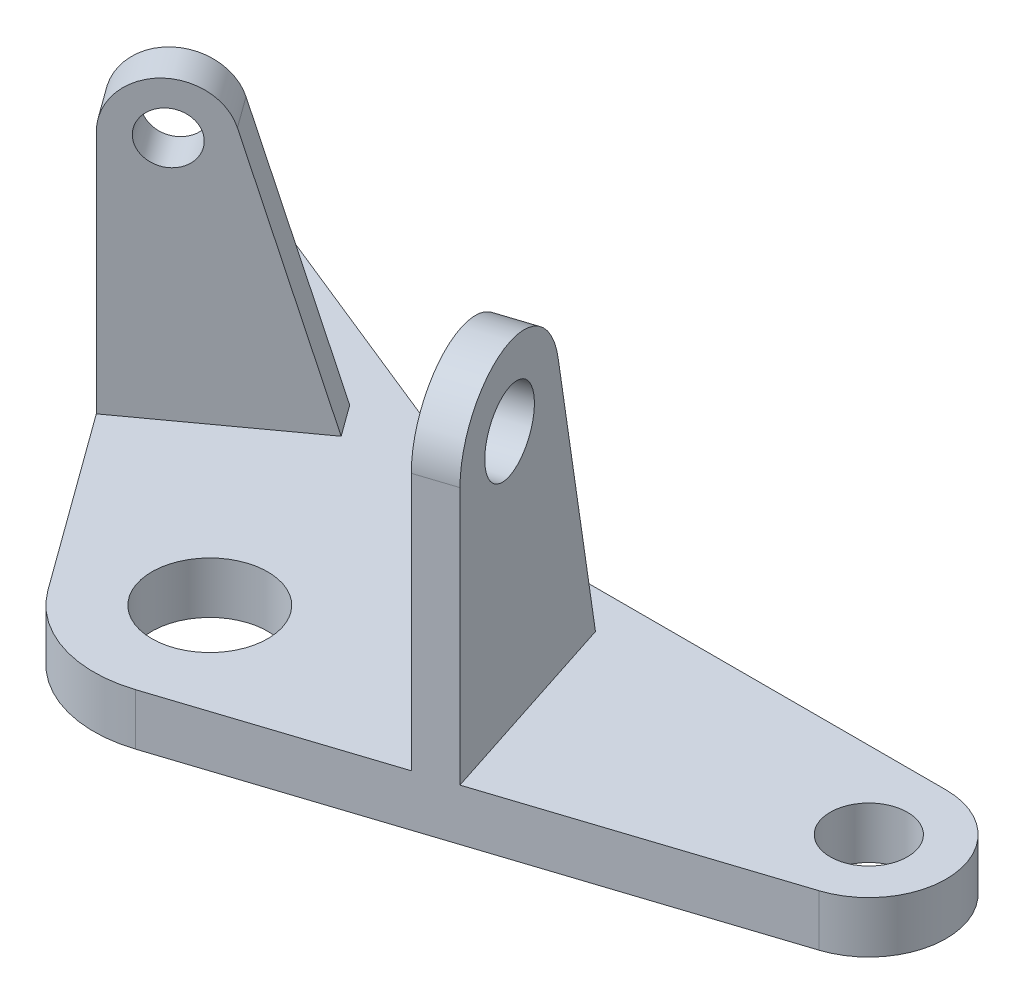
ISO-10303-21;
HEADER;
FILE_DESCRIPTION(('STEP AP214'),'2;1');
FILE_NAME('part.step','',(''),(''),'','','');
FILE_SCHEMA(('AUTOMOTIVE_DESIGN { 1 0 10303 214 1 1 1 1 }'));
ENDSEC;
DATA;
#1=APPLICATION_CONTEXT('core data for automotive mechanical design processes');
#2=APPLICATION_PROTOCOL_DEFINITION('international standard','automotive_design',2000,#1);
#3=PRODUCT_CONTEXT('',#1,'mechanical');
#4=PRODUCT('Part','Part','',(#3));
#5=PRODUCT_RELATED_PRODUCT_CATEGORY('part','',(#4));
#6=PRODUCT_DEFINITION_FORMATION('','',#4);
#7=PRODUCT_DEFINITION_CONTEXT('part definition',#1,'design');
#8=PRODUCT_DEFINITION('design','',#6,#7);
#9=PRODUCT_DEFINITION_SHAPE('','',#8);
#10=(LENGTH_UNIT() NAMED_UNIT(*) SI_UNIT(.MILLI.,.METRE.));
#11=(NAMED_UNIT(*) PLANE_ANGLE_UNIT() SI_UNIT($,.RADIAN.));
#12=(NAMED_UNIT(*) SI_UNIT($,.STERADIAN.) SOLID_ANGLE_UNIT());
#13=UNCERTAINTY_MEASURE_WITH_UNIT(LENGTH_MEASURE(1.E-05),#10,'distance_accuracy_value','');
#14=(GEOMETRIC_REPRESENTATION_CONTEXT(3) GLOBAL_UNCERTAINTY_ASSIGNED_CONTEXT((#13)) GLOBAL_UNIT_ASSIGNED_CONTEXT((#10,
#11,#12)) REPRESENTATION_CONTEXT('',''));
#15=CARTESIAN_POINT('',(0.,0.,0.));
#16=DIRECTION('',(0.,0.,1.));
#17=DIRECTION('',(1.,0.,0.));
#18=AXIS2_PLACEMENT_3D('',#15,#16,#17);
#19=CARTESIAN_POINT('',(82.,8.,-20.3346417456688));
#20=DIRECTION('',(0.,1.,0.));
#21=DIRECTION('',(0.,0.,1.));
#22=AXIS2_PLACEMENT_3D('',#19,#20,#21);
#23=PLANE('',#22);
#24=DIRECTION('',(-0.309016994374949,0.,-0.951056516295153));
#25=VECTOR('',#24,1.);
#26=CARTESIAN_POINT('',(38.0422606518061,8.,-12.360679774998));
#27=LINE('',#26,#25);
#28=CARTESIAN_POINT('',(43.6045665505552,8.,4.75833751831481));
#29=VERTEX_POINT('',#28);
#30=CARTESIAN_POINT('',(33.4779716109458,8.,-26.4081170149633));
#31=VERTEX_POINT('',#30);
#32=EDGE_CURVE('E176',#29,#31,#27,.T.);
#33=ORIENTED_EDGE('',*,*,#32,.F.);
#34=DIRECTION('',(0.951056516295153,0.,-0.309016994374949));
#35=VECTOR('',#34,1.);
#36=CARTESIAN_POINT('',(85.7082039324994,8.,-8.92196355012698));
#37=LINE('',#36,#35);
#38=CARTESIAN_POINT('',(85.7082039324994,8.,-8.92196355012698));
#39=VERTEX_POINT('',#38);
#40=EDGE_CURVE('E287',#29,#39,#37,.T.);
#41=ORIENTED_EDGE('',*,*,#40,.T.);
#42=CARTESIAN_POINT('',(82.,8.,-20.3346417456688));
#43=DIRECTION('',(0.,1.,0.));
#44=DIRECTION('',(0.,0.,1.));
#45=AXIS2_PLACEMENT_3D('',#42,#43,#44);
#46=CIRCLE('',#45,12.);
#47=CARTESIAN_POINT('',(82.,8.,-32.3346417456688));
#48=VERTEX_POINT('',#47);
#49=EDGE_CURVE('E266',#39,#48,#46,.T.);
#50=ORIENTED_EDGE('',*,*,#49,.T.);
#51=DIRECTION('',(-1.,0.,0.));
#52=VECTOR('',#51,1.);
#53=CARTESIAN_POINT('',(82.,8.,-32.3346417456688));
#54=LINE('',#53,#52);
#55=CARTESIAN_POINT('',(22.89988117621,8.,-32.3346417456688));
#56=VERTEX_POINT('',#55);
#57=EDGE_CURVE('E270',#48,#56,#54,.T.);
#58=ORIENTED_EDGE('',*,*,#57,.T.);
#59=CARTESIAN_POINT('',(22.89988117621,8.,-74.3346417456688));
#60=DIRECTION('',(0.,1.,0.));
#61=DIRECTION('',(0.,0.,1.));
#62=AXIS2_PLACEMENT_3D('',#59,#60,#61);
#63=CIRCLE('',#62,42.);
#64=CARTESIAN_POINT('',(7.16640425274162,8.,-35.3929198538638));
#65=VERTEX_POINT('',#64);
#66=EDGE_CURVE('E11',#56,#65,#63,.F.);
#67=ORIENTED_EDGE('',*,*,#66,.T.);
#68=DIRECTION('',(-0.927183854566787,0.,-0.374606593415913));
#69=VECTOR('',#68,1.);
#70=CARTESIAN_POINT('',(14.7359081924258,8.,-32.3346417456688));
#71=LINE('',#70,#69);
#72=CARTESIAN_POINT('',(-45.0031472526727,8.,-56.4707868521092));
#73=VERTEX_POINT('',#72);
#74=EDGE_CURVE('E274',#65,#73,#71,.T.);
#75=ORIENTED_EDGE('',*,*,#74,.T.);
#76=CARTESIAN_POINT('',(-48.,8.,-49.0533160155749));
#77=DIRECTION('',(0.,1.,0.));
#78=DIRECTION('',(0.,0.,1.));
#79=AXIS2_PLACEMENT_3D('',#76,#77,#78);
#80=CIRCLE('',#79,7.99999999999999);
#81=CARTESIAN_POINT('',(-54.4721359549996,8.,-44.3510339972351));
#82=VERTEX_POINT('',#81);
#83=EDGE_CURVE('E277',#73,#82,#80,.T.);
#84=ORIENTED_EDGE('',*,*,#83,.T.);
#85=DIRECTION('',(0.587785252292478,0.,0.809016994374944));
#86=VECTOR('',#85,1.);
#87=CARTESIAN_POINT('',(-54.4721359549996,8.,-44.3510339972351));
#88=LINE('',#87,#86);
#89=CARTESIAN_POINT('',(-38.0737159904481,8.,-21.7805452337332));
#90=VERTEX_POINT('',#89);
#91=EDGE_CURVE('E281',#82,#90,#88,.T.);
#92=ORIENTED_EDGE('',*,*,#91,.T.);
#93=DIRECTION('',(0.809016994374944,0.,-0.587785252292478));
#94=VECTOR('',#93,1.);
#95=CARTESIAN_POINT('',(-23.5114100916991,8.,-32.3606797749978));
#96=LINE('',#95,#94);
#97=CARTESIAN_POINT('',(-16.0533088274187,8.,-37.7793075216681));
#98=VERTEX_POINT('',#97);
#99=EDGE_CURVE('E225',#90,#98,#96,.T.);
#100=ORIENTED_EDGE('',*,*,#99,.T.);
#101=DIRECTION('',(-0.587785252292478,0.,-0.809016994374944));
#102=VECTOR('',#101,1.);
#103=CARTESIAN_POINT('',(-12.5265973136639,8.,-32.9252055554184));
#104=LINE('',#103,#102);
#105=CARTESIAN_POINT('',(-12.5265973136639,8.,-32.9252055554184));
#106=VERTEX_POINT('',#105);
#107=EDGE_CURVE('E216',#106,#98,#104,.T.);
#108=ORIENTED_EDGE('',*,*,#107,.F.);
#109=DIRECTION('',(0.809016994374944,0.,-0.587785252292478));
#110=VECTOR('',#109,1.);
#111=CARTESIAN_POINT('',(-19.9846985779442,8.,-27.5065778087481));
#112=LINE('',#111,#110);
#113=CARTESIAN_POINT('',(-34.5470044766932,8.,-16.9264432674835));
#114=VERTEX_POINT('',#113);
#115=EDGE_CURVE('E209',#114,#106,#112,.T.);
#116=ORIENTED_EDGE('',*,*,#115,.F.);
#117=CARTESIAN_POINT('',(-14.562305898749,8.,10.5801345412646));
#118=VERTEX_POINT('',#117);
#119=EDGE_CURVE('E280',#114,#118,#88,.T.);
#120=ORIENTED_EDGE('',*,*,#119,.T.);
#121=CARTESIAN_POINT('',(0.,8.,0.));
#122=DIRECTION('',(0.,1.,0.));
#123=DIRECTION('',(0.,0.,1.));
#124=AXIS2_PLACEMENT_3D('',#121,#122,#123);
#125=CIRCLE('',#124,18.);
#126=CARTESIAN_POINT('',(5.56230589874908,8.,17.1190172933127));
#127=VERTEX_POINT('',#126);
#128=EDGE_CURVE('E284',#118,#127,#125,.T.);
#129=ORIENTED_EDGE('',*,*,#128,.T.);
#130=CARTESIAN_POINT('',(37.8982274527843,8.,6.61243948456451));
#131=VERTEX_POINT('',#130);
#132=EDGE_CURVE('E288',#127,#131,#37,.T.);
#133=ORIENTED_EDGE('',*,*,#132,.T.);
#134=DIRECTION('',(-0.309016994374949,0.,-0.951056516295153));
#135=VECTOR('',#134,1.);
#136=CARTESIAN_POINT('',(32.3359215540352,8.,-10.5065778087483));
#137=LINE('',#136,#135);
#138=CARTESIAN_POINT('',(27.7716325131749,8.,-24.5540150487136));
#139=VERTEX_POINT('',#138);
#140=EDGE_CURVE('E364',#131,#139,#137,.T.);
#141=ORIENTED_EDGE('',*,*,#140,.T.);
#142=DIRECTION('',(-0.951056516295153,0.,0.309016994374949));
#143=VECTOR('',#142,1.);
#144=CARTESIAN_POINT('',(33.4779716109458,8.,-26.4081170149633));
#145=LINE('',#144,#143);
#146=EDGE_CURVE('E193',#31,#139,#145,.T.);
#147=ORIENTED_EDGE('',*,*,#146,.F.);
#148=EDGE_LOOP('',(#33,#41,#50,#58,#67,#75,#84,#92,#100,#108,#116,#120,#129,#133,#141,#147));
#149=FACE_BOUND('',#148,.T.);
#150=CARTESIAN_POINT('',(82.,8.,-20.3346417456688));
#151=DIRECTION('',(0.,1.,0.));
#152=DIRECTION('',(0.,0.,1.));
#153=AXIS2_PLACEMENT_3D('',#150,#151,#152);
#154=CIRCLE('',#153,6.);
#155=CARTESIAN_POINT('',(82.,8.,-14.3346417456688));
#156=VERTEX_POINT('',#155);
#157=EDGE_CURVE('E250',#156,#156,#154,.T.);
#158=ORIENTED_EDGE('',*,*,#157,.F.);
#159=EDGE_LOOP('',(#158));
#160=FACE_BOUND('',#159,.T.);
#161=CARTESIAN_POINT('',(0.,8.,0.));
#162=DIRECTION('',(0.,1.,0.));
#163=DIRECTION('',(0.,0.,1.));
#164=AXIS2_PLACEMENT_3D('',#161,#162,#163);
#165=CIRCLE('',#164,9.);
#166=CARTESIAN_POINT('',(0.,8.,9.));
#167=VERTEX_POINT('',#166);
#168=EDGE_CURVE('E258',#167,#167,#165,.T.);
#169=ORIENTED_EDGE('',*,*,#168,.F.);
#170=EDGE_LOOP('',(#169));
#171=FACE_BOUND('',#170,.T.);
#172=CARTESIAN_POINT('',(-48.,8.,-49.0533160155749));
#173=DIRECTION('',(0.,1.,0.));
#174=DIRECTION('',(0.,0.,1.));
#175=AXIS2_PLACEMENT_3D('',#172,#173,#174);
#176=CIRCLE('',#175,4.00000000000001);
#177=CARTESIAN_POINT('',(-48.,8.,-45.0533160155749));
#178=VERTEX_POINT('',#177);
#179=EDGE_CURVE('E242',#178,#178,#176,.T.);
#180=ORIENTED_EDGE('',*,*,#179,.F.);
#181=EDGE_LOOP('',(#180));
#182=FACE_BOUND('',#181,.T.);
#183=ADVANCED_FACE('F44',(#149,#160,#171,#182),#23,.T.);
#184=CARTESIAN_POINT('',(82.,0.,-20.3346417456688));
#185=DIRECTION('',(0.,1.,0.));
#186=DIRECTION('',(0.,0.,1.));
#187=AXIS2_PLACEMENT_3D('',#184,#185,#186);
#188=PLANE('',#187);
#189=CARTESIAN_POINT('',(82.,0.,-20.3346417456688));
#190=DIRECTION('',(0.,1.,0.));
#191=DIRECTION('',(0.,0.,1.));
#192=AXIS2_PLACEMENT_3D('',#189,#190,#191);
#193=CIRCLE('',#192,12.);
#194=CARTESIAN_POINT('',(85.7082039324994,0.,-8.92196355012698));
#195=VERTEX_POINT('',#194);
#196=CARTESIAN_POINT('',(82.,0.,-32.3346417456688));
#197=VERTEX_POINT('',#196);
#198=EDGE_CURVE('E262',#195,#197,#193,.T.);
#199=ORIENTED_EDGE('',*,*,#198,.F.);
#200=DIRECTION('',(0.951056516295153,0.,-0.309016994374949));
#201=VECTOR('',#200,1.);
#202=CARTESIAN_POINT('',(85.7082039324994,0.,-8.92196355012698));
#203=LINE('',#202,#201);
#204=CARTESIAN_POINT('',(5.56230589874908,0.,17.1190172933127));
#205=VERTEX_POINT('',#204);
#206=EDGE_CURVE('E271',#205,#195,#203,.T.);
#207=ORIENTED_EDGE('',*,*,#206,.F.);
#208=CARTESIAN_POINT('',(0.,0.,0.));
#209=DIRECTION('',(0.,1.,0.));
#210=DIRECTION('',(0.,0.,1.));
#211=AXIS2_PLACEMENT_3D('',#208,#209,#210);
#212=CIRCLE('',#211,18.);
#213=CARTESIAN_POINT('',(-14.562305898749,0.,10.5801345412646));
#214=VERTEX_POINT('',#213);
#215=EDGE_CURVE('E307',#214,#205,#212,.T.);
#216=ORIENTED_EDGE('',*,*,#215,.F.);
#217=DIRECTION('',(0.587785252292478,0.,0.809016994374944));
#218=VECTOR('',#217,1.);
#219=CARTESIAN_POINT('',(-54.4721359549996,0.,-44.3510339972351));
#220=LINE('',#219,#218);
#221=CARTESIAN_POINT('',(-54.4721359549996,0.,-44.3510339972351));
#222=VERTEX_POINT('',#221);
#223=EDGE_CURVE('E304',#222,#214,#220,.T.);
#224=ORIENTED_EDGE('',*,*,#223,.F.);
#225=CARTESIAN_POINT('',(-48.,0.,-49.0533160155749));
#226=DIRECTION('',(0.,1.,0.));
#227=DIRECTION('',(0.,0.,1.));
#228=AXIS2_PLACEMENT_3D('',#225,#226,#227);
#229=CIRCLE('',#228,7.99999999999999);
#230=CARTESIAN_POINT('',(-45.0031472526727,0.,-56.4707868521092));
#231=VERTEX_POINT('',#230);
#232=EDGE_CURVE('E301',#231,#222,#229,.T.);
#233=ORIENTED_EDGE('',*,*,#232,.F.);
#234=DIRECTION('',(-0.927183854566787,0.,-0.374606593415913));
#235=VECTOR('',#234,1.);
#236=CARTESIAN_POINT('',(14.7359081924258,0.,-32.3346417456688));
#237=LINE('',#236,#235);
#238=CARTESIAN_POINT('',(7.16640425274162,0.,-35.3929198538638));
#239=VERTEX_POINT('',#238);
#240=EDGE_CURVE('E298',#239,#231,#237,.T.);
#241=ORIENTED_EDGE('',*,*,#240,.F.);
#242=CARTESIAN_POINT('',(22.89988117621,0.,-74.3346417456688));
#243=DIRECTION('',(0.,1.,0.));
#244=DIRECTION('',(0.,0.,1.));
#245=AXIS2_PLACEMENT_3D('',#242,#243,#244);
#246=CIRCLE('',#245,42.);
#247=CARTESIAN_POINT('',(22.89988117621,0.,-32.3346417456688));
#248=VERTEX_POINT('',#247);
#249=EDGE_CURVE('E53',#239,#248,#246,.T.);
#250=ORIENTED_EDGE('',*,*,#249,.T.);
#251=DIRECTION('',(-1.,0.,0.));
#252=VECTOR('',#251,1.);
#253=CARTESIAN_POINT('',(82.,0.,-32.3346417456688));
#254=LINE('',#253,#252);
#255=EDGE_CURVE('E295',#197,#248,#254,.T.);
#256=ORIENTED_EDGE('',*,*,#255,.F.);
#257=EDGE_LOOP('',(#199,#207,#216,#224,#233,#241,#250,#256));
#258=FACE_BOUND('',#257,.T.);
#259=CARTESIAN_POINT('',(0.,0.,0.));
#260=DIRECTION('',(0.,1.,0.));
#261=DIRECTION('',(0.,0.,1.));
#262=AXIS2_PLACEMENT_3D('',#259,#260,#261);
#263=CIRCLE('',#262,9.);
#264=CARTESIAN_POINT('',(0.,0.,9.));
#265=VERTEX_POINT('',#264);
#266=EDGE_CURVE('E254',#265,#265,#263,.T.);
#267=ORIENTED_EDGE('',*,*,#266,.T.);
#268=EDGE_LOOP('',(#267));
#269=FACE_BOUND('',#268,.T.);
#270=CARTESIAN_POINT('',(82.,0.,-20.3346417456688));
#271=DIRECTION('',(0.,1.,0.));
#272=DIRECTION('',(0.,0.,1.));
#273=AXIS2_PLACEMENT_3D('',#270,#271,#272);
#274=CIRCLE('',#273,6.);
#275=CARTESIAN_POINT('',(82.,0.,-14.3346417456688));
#276=VERTEX_POINT('',#275);
#277=EDGE_CURVE('E246',#276,#276,#274,.T.);
#278=ORIENTED_EDGE('',*,*,#277,.T.);
#279=EDGE_LOOP('',(#278));
#280=FACE_BOUND('',#279,.T.);
#281=CARTESIAN_POINT('',(-48.,0.,-49.0533160155749));
#282=DIRECTION('',(0.,1.,0.));
#283=DIRECTION('',(0.,0.,1.));
#284=AXIS2_PLACEMENT_3D('',#281,#282,#283);
#285=CIRCLE('',#284,4.00000000000001);
#286=CARTESIAN_POINT('',(-48.,0.,-45.0533160155749));
#287=VERTEX_POINT('',#286);
#288=EDGE_CURVE('E241',#287,#287,#285,.T.);
#289=ORIENTED_EDGE('',*,*,#288,.T.);
#290=EDGE_LOOP('',(#289));
#291=FACE_BOUND('',#290,.T.);
#292=ADVANCED_FACE('F443',(#258,#269,#280,#291),#188,.F.);
#293=CARTESIAN_POINT('',(82.,8.,-20.3346417456688));
#294=DIRECTION('',(0.,-1.,0.));
#295=DIRECTION('',(0.,0.,-1.));
#296=AXIS2_PLACEMENT_3D('',#293,#294,#295);
#297=CYLINDRICAL_SURFACE('',#296,12.);
#298=ORIENTED_EDGE('',*,*,#198,.T.);
#299=DIRECTION('',(0.,-1.,0.));
#300=VECTOR('',#299,1.);
#301=CARTESIAN_POINT('',(82.,8.,-32.3346417456688));
#302=LINE('',#301,#300);
#303=EDGE_CURVE('E331',#48,#197,#302,.T.);
#304=ORIENTED_EDGE('',*,*,#303,.F.);
#305=ORIENTED_EDGE('',*,*,#49,.F.);
#306=DIRECTION('',(0.,-1.,0.));
#307=VECTOR('',#306,1.);
#308=CARTESIAN_POINT('',(85.7082039324994,8.,-8.92196355012698));
#309=LINE('',#308,#307);
#310=EDGE_CURVE('E291',#39,#195,#309,.T.);
#311=ORIENTED_EDGE('',*,*,#310,.T.);
#312=EDGE_LOOP('',(#298,#304,#305,#311));
#313=FACE_BOUND('',#312,.T.);
#314=ADVANCED_FACE('F396',(#313),#297,.T.);
#315=CARTESIAN_POINT('',(82.,8.,-32.3346417456688));
#316=DIRECTION('',(0.,0.,1.));
#317=DIRECTION('',(1.,0.,0.));
#318=AXIS2_PLACEMENT_3D('',#315,#316,#317);
#319=PLANE('',#318);
#320=ORIENTED_EDGE('',*,*,#255,.T.);
#321=DIRECTION('',(0.,-1.,0.));
#322=VECTOR('',#321,1.);
#323=CARTESIAN_POINT('',(22.89988117621,8.,-32.3346417456688));
#324=LINE('',#323,#322);
#325=EDGE_CURVE('E60',#248,#56,#324,.F.);
#326=ORIENTED_EDGE('',*,*,#325,.T.);
#327=ORIENTED_EDGE('',*,*,#57,.F.);
#328=ORIENTED_EDGE('',*,*,#303,.T.);
#329=EDGE_LOOP('',(#320,#326,#327,#328));
#330=FACE_BOUND('',#329,.T.);
#331=ADVANCED_FACE('F398',(#330),#319,.F.);
#332=CARTESIAN_POINT('',(14.7359081924258,8.,-32.3346417456688));
#333=DIRECTION('',(-0.374606593415913,0.,0.927183854566787));
#334=DIRECTION('',(0.927183854566787,0.,0.374606593415913));
#335=AXIS2_PLACEMENT_3D('',#332,#333,#334);
#336=PLANE('',#335);
#337=ORIENTED_EDGE('',*,*,#74,.F.);
#338=DIRECTION('',(0.,-1.,0.));
#339=VECTOR('',#338,1.);
#340=CARTESIAN_POINT('',(7.16640425274162,0.,-35.3929198538638));
#341=LINE('',#340,#339);
#342=EDGE_CURVE('E335',#65,#239,#341,.T.);
#343=ORIENTED_EDGE('',*,*,#342,.T.);
#344=ORIENTED_EDGE('',*,*,#240,.T.);
#345=DIRECTION('',(0.,-1.,0.));
#346=VECTOR('',#345,1.);
#347=CARTESIAN_POINT('',(-45.0031472526727,8.,-56.4707868521092));
#348=LINE('',#347,#346);
#349=EDGE_CURVE('E327',#73,#231,#348,.T.);
#350=ORIENTED_EDGE('',*,*,#349,.F.);
#351=EDGE_LOOP('',(#337,#343,#344,#350));
#352=FACE_BOUND('',#351,.T.);
#353=ADVANCED_FACE('F404',(#352),#336,.F.);
#354=CARTESIAN_POINT('',(-48.,8.,-49.0533160155749));
#355=DIRECTION('',(0.,-1.,0.));
#356=DIRECTION('',(0.,0.,-1.));
#357=AXIS2_PLACEMENT_3D('',#354,#355,#356);
#358=CYLINDRICAL_SURFACE('',#357,7.99999999999999);
#359=ORIENTED_EDGE('',*,*,#232,.T.);
#360=DIRECTION('',(0.,-1.,0.));
#361=VECTOR('',#360,1.);
#362=CARTESIAN_POINT('',(-54.4721359549996,8.,-44.3510339972351));
#363=LINE('',#362,#361);
#364=EDGE_CURVE('E323',#82,#222,#363,.T.);
#365=ORIENTED_EDGE('',*,*,#364,.F.);
#366=ORIENTED_EDGE('',*,*,#83,.F.);
#367=ORIENTED_EDGE('',*,*,#349,.T.);
#368=EDGE_LOOP('',(#359,#365,#366,#367));
#369=FACE_BOUND('',#368,.T.);
#370=ADVANCED_FACE('F409',(#369),#358,.T.);
#371=CARTESIAN_POINT('',(-54.4721359549996,8.,-44.3510339972351));
#372=DIRECTION('',(0.809016994374944,0.,-0.587785252292478));
#373=DIRECTION('',(-0.587785252292478,0.,-0.809016994374944));
#374=AXIS2_PLACEMENT_3D('',#371,#372,#373);
#375=PLANE('',#374);
#376=ORIENTED_EDGE('',*,*,#223,.T.);
#377=DIRECTION('',(0.,-1.,0.));
#378=VECTOR('',#377,1.);
#379=CARTESIAN_POINT('',(-14.562305898749,8.,10.5801345412646));
#380=LINE('',#379,#378);
#381=EDGE_CURVE('E319',#118,#214,#380,.T.);
#382=ORIENTED_EDGE('',*,*,#381,.F.);
#383=ORIENTED_EDGE('',*,*,#119,.F.);
#384=DIRECTION('',(0.,1.,0.));
#385=VECTOR('',#384,1.);
#386=CARTESIAN_POINT('',(-34.5470044766932,0.,-16.9264432674835));
#387=LINE('',#386,#385);
#388=CARTESIAN_POINT('',(-34.5470044766932,46.,-16.9264432674835));
#389=VERTEX_POINT('',#388);
#390=EDGE_CURVE('E205',#114,#389,#387,.T.);
#391=ORIENTED_EDGE('',*,*,#390,.T.);
#392=DIRECTION('',(-0.587785252292478,0.,-0.809016994374944));
#393=VECTOR('',#392,1.);
#394=CARTESIAN_POINT('',(-34.5470044766932,46.,-16.9264432674835));
#395=LINE('',#394,#393);
#396=CARTESIAN_POINT('',(-38.0737159904481,46.,-21.7805452337332));
#397=VERTEX_POINT('',#396);
#398=EDGE_CURVE('E234',#389,#397,#395,.T.);
#399=ORIENTED_EDGE('',*,*,#398,.T.);
#400=DIRECTION('',(0.,1.,0.));
#401=VECTOR('',#400,1.);
#402=CARTESIAN_POINT('',(-38.0737159904481,0.,-21.7805452337332));
#403=LINE('',#402,#401);
#404=EDGE_CURVE('E221',#90,#397,#403,.T.);
#405=ORIENTED_EDGE('',*,*,#404,.F.);
#406=ORIENTED_EDGE('',*,*,#91,.F.);
#407=ORIENTED_EDGE('',*,*,#364,.T.);
#408=EDGE_LOOP('',(#376,#382,#383,#391,#399,#405,#406,#407));
#409=FACE_BOUND('',#408,.T.);
#410=ADVANCED_FACE('F351',(#409),#375,.F.);
#411=CARTESIAN_POINT('',(0.,8.,0.));
#412=DIRECTION('',(0.,-1.,0.));
#413=DIRECTION('',(0.,0.,-1.));
#414=AXIS2_PLACEMENT_3D('',#411,#412,#413);
#415=CYLINDRICAL_SURFACE('',#414,18.);
#416=ORIENTED_EDGE('',*,*,#215,.T.);
#417=DIRECTION('',(0.,-1.,0.));
#418=VECTOR('',#417,1.);
#419=CARTESIAN_POINT('',(5.56230589874908,8.,17.1190172933127));
#420=LINE('',#419,#418);
#421=EDGE_CURVE('E315',#127,#205,#420,.T.);
#422=ORIENTED_EDGE('',*,*,#421,.F.);
#423=ORIENTED_EDGE('',*,*,#128,.F.);
#424=ORIENTED_EDGE('',*,*,#381,.T.);
#425=EDGE_LOOP('',(#416,#422,#423,#424));
#426=FACE_BOUND('',#425,.T.);
#427=ADVANCED_FACE('F355',(#426),#415,.T.);
#428=CARTESIAN_POINT('',(85.7082039324994,8.,-8.92196355012698));
#429=DIRECTION('',(-0.309016994374949,0.,-0.951056516295153));
#430=DIRECTION('',(-0.951056516295153,0.,0.309016994374949));
#431=AXIS2_PLACEMENT_3D('',#428,#429,#430);
#432=PLANE('',#431);
#433=ORIENTED_EDGE('',*,*,#206,.T.);
#434=ORIENTED_EDGE('',*,*,#310,.F.);
#435=ORIENTED_EDGE('',*,*,#40,.F.);
#436=DIRECTION('',(0.,1.,0.));
#437=VECTOR('',#436,1.);
#438=CARTESIAN_POINT('',(43.6045665505552,0.,4.75833751831481));
#439=LINE('',#438,#437);
#440=CARTESIAN_POINT('',(43.6045665505552,47.9999999999999,4.75833751831481));
#441=VERTEX_POINT('',#440);
#442=EDGE_CURVE('E168',#29,#441,#439,.T.);
#443=ORIENTED_EDGE('',*,*,#442,.T.);
#444=DIRECTION('',(-0.951056516295153,0.,0.309016994374949));
#445=VECTOR('',#444,1.);
#446=CARTESIAN_POINT('',(43.6045665505552,47.9999999999999,4.75833751831481));
#447=LINE('',#446,#445);
#448=CARTESIAN_POINT('',(37.8982274527843,47.9999999999999,6.61243948456451));
#449=VERTEX_POINT('',#448);
#450=EDGE_CURVE('E163',#441,#449,#447,.T.);
#451=ORIENTED_EDGE('',*,*,#450,.T.);
#452=DIRECTION('',(0.,1.,0.));
#453=VECTOR('',#452,1.);
#454=CARTESIAN_POINT('',(37.8982274527843,0.,6.61243948456451));
#455=LINE('',#454,#453);
#456=EDGE_CURVE('E362',#131,#449,#455,.T.);
#457=ORIENTED_EDGE('',*,*,#456,.F.);
#458=ORIENTED_EDGE('',*,*,#132,.F.);
#459=ORIENTED_EDGE('',*,*,#421,.T.);
#460=EDGE_LOOP('',(#433,#434,#435,#443,#451,#457,#458,#459));
#461=FACE_BOUND('',#460,.T.);
#462=ADVANCED_FACE('F360',(#461),#432,.F.);
#463=CARTESIAN_POINT('',(0.,8.,0.));
#464=DIRECTION('',(0.,-1.,0.));
#465=DIRECTION('',(0.,0.,-1.));
#466=AXIS2_PLACEMENT_3D('',#463,#464,#465);
#467=CYLINDRICAL_SURFACE('',#466,9.);
#468=ORIENTED_EDGE('',*,*,#168,.T.);
#469=EDGE_LOOP('',(#468));
#470=FACE_BOUND('',#469,.T.);
#471=ORIENTED_EDGE('',*,*,#266,.F.);
#472=EDGE_LOOP('',(#471));
#473=FACE_BOUND('',#472,.T.);
#474=ADVANCED_FACE('F451',(#470,#473),#467,.F.);
#475=CARTESIAN_POINT('',(82.,8.,-20.3346417456688));
#476=DIRECTION('',(0.,-1.,0.));
#477=DIRECTION('',(0.,0.,-1.));
#478=AXIS2_PLACEMENT_3D('',#475,#476,#477);
#479=CYLINDRICAL_SURFACE('',#478,6.);
#480=ORIENTED_EDGE('',*,*,#157,.T.);
#481=EDGE_LOOP('',(#480));
#482=FACE_BOUND('',#481,.T.);
#483=ORIENTED_EDGE('',*,*,#277,.F.);
#484=EDGE_LOOP('',(#483));
#485=FACE_BOUND('',#484,.T.);
#486=ADVANCED_FACE('F511',(#482,#485),#479,.F.);
#487=CARTESIAN_POINT('',(-48.,8.,-49.0533160155749));
#488=DIRECTION('',(0.,-1.,0.));
#489=DIRECTION('',(0.,0.,-1.));
#490=AXIS2_PLACEMENT_3D('',#487,#488,#489);
#491=CYLINDRICAL_SURFACE('',#490,4.00000000000001);
#492=ORIENTED_EDGE('',*,*,#179,.T.);
#493=EDGE_LOOP('',(#492));
#494=FACE_BOUND('',#493,.T.);
#495=ORIENTED_EDGE('',*,*,#288,.F.);
#496=EDGE_LOOP('',(#495));
#497=FACE_BOUND('',#496,.T.);
#498=ADVANCED_FACE('F518',(#494,#497),#491,.F.);
#499=CARTESIAN_POINT('',(-11.3783788951013,3.05039631377227,-33.7594350679432));
#500=DIRECTION('',(-0.777677048055779,-0.275637355817003,0.565015448466199));
#501=DIRECTION('',(0.587785252292478,0.,0.809016994374944));
#502=AXIS2_PLACEMENT_3D('',#499,#500,#501);
#503=PLANE('',#502);
#504=DIRECTION('',(-0.222995305140529,0.961261695938318,0.162015572730129));
#505=VECTOR('',#504,1.);
#506=CARTESIAN_POINT('',(-14.9050904088562,3.05039631377227,-38.6135370341928));
#507=LINE('',#506,#505);
#508=CARTESIAN_POINT('',(-25.3801636510023,48.205098846536,-31.0029508398026));
#509=VERTEX_POINT('',#508);
#510=EDGE_CURVE('E186',#98,#509,#507,.T.);
#511=ORIENTED_EDGE('',*,*,#510,.T.);
#512=DIRECTION('',(-0.587785252292478,0.,-0.809016994374944));
#513=VECTOR('',#512,1.);
#514=CARTESIAN_POINT('',(-21.8534521372474,48.205098846536,-26.1488488735529));
#515=LINE('',#514,#513);
#516=CARTESIAN_POINT('',(-21.8534521372474,48.205098846536,-26.1488488735529));
#517=VERTEX_POINT('',#516);
#518=EDGE_CURVE('E237',#517,#509,#515,.T.);
#519=ORIENTED_EDGE('',*,*,#518,.F.);
#520=DIRECTION('',(-0.222995305140529,0.961261695938318,0.162015572730129));
#521=VECTOR('',#520,1.);
#522=CARTESIAN_POINT('',(-11.3783788951013,3.05039631377227,-33.7594350679432));
#523=LINE('',#522,#521);
#524=EDGE_CURVE('E197',#106,#517,#523,.T.);
#525=ORIENTED_EDGE('',*,*,#524,.F.);
#526=ORIENTED_EDGE('',*,*,#107,.T.);
#527=EDGE_LOOP('',(#511,#519,#525,#526));
#528=FACE_BOUND('',#527,.T.);
#529=ADVANCED_FACE('F423',(#528),#503,.F.);
#530=CARTESIAN_POINT('',(-28.0748685216937,46.,-21.6287252858233));
#531=DIRECTION('',(-0.587785252292478,0.,-0.809016994374944));
#532=DIRECTION('',(-0.809016994374944,0.,0.587785252292478));
#533=AXIS2_PLACEMENT_3D('',#530,#531,#532);
#534=CYLINDRICAL_SURFACE('',#533,8.);
#535=CARTESIAN_POINT('',(-31.6015800354485,46.,-26.482827252073));
#536=DIRECTION('',(0.587785252292478,0.,0.809016994374944));
#537=DIRECTION('',(0.809016994374944,0.,-0.587785252292478));
#538=AXIS2_PLACEMENT_3D('',#535,#536,#537);
#539=CIRCLE('',#538,8.);
#540=EDGE_CURVE('E191',#509,#397,#539,.T.);
#541=ORIENTED_EDGE('',*,*,#540,.T.);
#542=ORIENTED_EDGE('',*,*,#398,.F.);
#543=CARTESIAN_POINT('',(-28.0748685216937,46.,-21.6287252858233));
#544=DIRECTION('',(0.587785252292478,0.,0.809016994374944));
#545=DIRECTION('',(0.809016994374944,0.,-0.587785252292478));
#546=AXIS2_PLACEMENT_3D('',#543,#544,#545);
#547=CIRCLE('',#546,8.);
#548=EDGE_CURVE('E201',#517,#389,#547,.T.);
#549=ORIENTED_EDGE('',*,*,#548,.F.);
#550=ORIENTED_EDGE('',*,*,#518,.T.);
#551=EDGE_LOOP('',(#541,#542,#549,#550));
#552=FACE_BOUND('',#551,.T.);
#553=ADVANCED_FACE('F419',(#552),#534,.T.);
#554=CARTESIAN_POINT('',(-28.0748685216937,46.,-21.6287252858233));
#555=DIRECTION('',(-0.587785252292478,0.,-0.809016994374944));
#556=DIRECTION('',(-0.809016994374944,0.,0.587785252292478));
#557=AXIS2_PLACEMENT_3D('',#554,#555,#556);
#558=CYLINDRICAL_SURFACE('',#557,4.);
#559=CARTESIAN_POINT('',(-28.0748685216937,46.,-21.6287252858233));
#560=DIRECTION('',(0.587785252292478,0.,0.809016994374944));
#561=DIRECTION('',(0.809016994374944,0.,-0.587785252292478));
#562=AXIS2_PLACEMENT_3D('',#559,#560,#561);
#563=CIRCLE('',#562,4.);
#564=CARTESIAN_POINT('',(-24.8388005441939,46.,-23.9798662949932));
#565=VERTEX_POINT('',#564);
#566=EDGE_CURVE('E213',#565,#565,#563,.T.);
#567=ORIENTED_EDGE('',*,*,#566,.T.);
#568=EDGE_LOOP('',(#567));
#569=FACE_BOUND('',#568,.T.);
#570=CARTESIAN_POINT('',(-31.6015800354485,46.,-26.482827252073));
#571=DIRECTION('',(0.587785252292478,0.,0.809016994374944));
#572=DIRECTION('',(0.809016994374944,0.,-0.587785252292478));
#573=AXIS2_PLACEMENT_3D('',#570,#571,#572);
#574=CIRCLE('',#573,4.);
#575=CARTESIAN_POINT('',(-28.3655120579488,46.,-28.8339682612429));
#576=VERTEX_POINT('',#575);
#577=EDGE_CURVE('E202',#576,#576,#574,.T.);
#578=ORIENTED_EDGE('',*,*,#577,.F.);
#579=EDGE_LOOP('',(#578));
#580=FACE_BOUND('',#579,.T.);
#581=ADVANCED_FACE('F428',(#569,#580),#558,.F.);
#582=CARTESIAN_POINT('',(-19.9846985779442,0.,-27.5065778087481));
#583=DIRECTION('',(0.587785252292478,0.,0.809016994374944));
#584=DIRECTION('',(0.809016994374944,0.,-0.587785252292478));
#585=AXIS2_PLACEMENT_3D('',#582,#583,#584);
#586=PLANE('',#585);
#587=ORIENTED_EDGE('',*,*,#524,.T.);
#588=ORIENTED_EDGE('',*,*,#548,.T.);
#589=ORIENTED_EDGE('',*,*,#390,.F.);
#590=ORIENTED_EDGE('',*,*,#115,.T.);
#591=EDGE_LOOP('',(#587,#588,#589,#590));
#592=FACE_BOUND('',#591,.T.);
#593=ORIENTED_EDGE('',*,*,#566,.F.);
#594=EDGE_LOOP('',(#593));
#595=FACE_BOUND('',#594,.T.);
#596=ADVANCED_FACE('F425',(#592,#595),#586,.T.);
#597=CARTESIAN_POINT('',(-23.5114100916991,0.,-32.3606797749978));
#598=DIRECTION('',(0.587785252292478,0.,0.809016994374944));
#599=DIRECTION('',(0.809016994374944,0.,-0.587785252292478));
#600=AXIS2_PLACEMENT_3D('',#597,#598,#599);
#601=PLANE('',#600);
#602=ORIENTED_EDGE('',*,*,#510,.F.);
#603=ORIENTED_EDGE('',*,*,#99,.F.);
#604=ORIENTED_EDGE('',*,*,#404,.T.);
#605=ORIENTED_EDGE('',*,*,#540,.F.);
#606=EDGE_LOOP('',(#602,#603,#604,#605));
#607=FACE_BOUND('',#606,.T.);
#608=ORIENTED_EDGE('',*,*,#577,.T.);
#609=EDGE_LOOP('',(#608));
#610=FACE_BOUND('',#609,.T.);
#611=ADVANCED_FACE('F415',(#607,#610),#601,.F.);
#612=CARTESIAN_POINT('',(33.1725192312713,3.34963937716339,-27.3482027752785));
#613=DIRECTION('',(0.302264231633828,-0.207911690817763,0.930273649576355));
#614=DIRECTION('',(0.951056516295153,0.,-0.309016994374949));
#615=AXIS2_PLACEMENT_3D('',#612,#613,#614);
#616=PLANE('',#615);
#617=DIRECTION('',(0.0642482457919189,0.978147600733805,0.197735768366177));
#618=VECTOR('',#617,1.);
#619=CARTESIAN_POINT('',(27.4661801335003,3.34963937716339,-25.4941008090289));
#620=LINE('',#619,#618);
#621=CARTESIAN_POINT('',(30.562852740679,50.4949402898131,-15.9635225058936));
#622=VERTEX_POINT('',#621);
#623=EDGE_CURVE('E184',#139,#622,#620,.T.);
#624=ORIENTED_EDGE('',*,*,#623,.T.);
#625=DIRECTION('',(-0.951056516295153,0.,0.309016994374949));
#626=VECTOR('',#625,1.);
#627=CARTESIAN_POINT('',(36.2691918384499,50.4949402898131,-17.8176244721433));
#628=LINE('',#627,#626);
#629=CARTESIAN_POINT('',(36.2691918384499,50.4949402898131,-17.8176244721433));
#630=VERTEX_POINT('',#629);
#631=EDGE_CURVE('E161',#630,#622,#628,.T.);
#632=ORIENTED_EDGE('',*,*,#631,.F.);
#633=DIRECTION('',(0.0642482457919189,0.978147600733805,0.197735768366177));
#634=VECTOR('',#633,1.);
#635=CARTESIAN_POINT('',(33.1725192312713,3.34963937716339,-27.3482027752785));
#636=LINE('',#635,#634);
#637=EDGE_CURVE('E169',#31,#630,#636,.T.);
#638=ORIENTED_EDGE('',*,*,#637,.F.);
#639=ORIENTED_EDGE('',*,*,#146,.T.);
#640=EDGE_LOOP('',(#624,#632,#638,#639));
#641=FACE_BOUND('',#640,.T.);
#642=ADVANCED_FACE('F182',(#641),#616,.F.);
#643=CARTESIAN_POINT('',(39.8963626180558,47.9999999999999,-6.65434067722702));
#644=DIRECTION('',(-0.951056516295153,0.,0.309016994374949));
#645=DIRECTION('',(0.309016994374949,0.,0.951056516295153));
#646=AXIS2_PLACEMENT_3D('',#643,#644,#645);
#647=CYLINDRICAL_SURFACE('',#646,12.);
#648=CARTESIAN_POINT('',(34.1900235202849,47.9999999999999,-4.80023871097733));
#649=DIRECTION('',(0.951056516295153,0.,-0.309016994374949));
#650=DIRECTION('',(-0.309016994374949,0.,-0.951056516295153));
#651=AXIS2_PLACEMENT_3D('',#648,#649,#650);
#652=CIRCLE('',#651,12.);
#653=EDGE_CURVE('E374',#622,#449,#652,.T.);
#654=ORIENTED_EDGE('',*,*,#653,.T.);
#655=ORIENTED_EDGE('',*,*,#450,.F.);
#656=CARTESIAN_POINT('',(39.8963626180558,47.9999999999999,-6.65434067722702));
#657=DIRECTION('',(0.951056516295153,0.,-0.309016994374949));
#658=DIRECTION('',(-0.309016994374949,0.,-0.951056516295153));
#659=AXIS2_PLACEMENT_3D('',#656,#657,#658);
#660=CIRCLE('',#659,12.);
#661=EDGE_CURVE('E156',#630,#441,#660,.T.);
#662=ORIENTED_EDGE('',*,*,#661,.F.);
#663=ORIENTED_EDGE('',*,*,#631,.T.);
#664=EDGE_LOOP('',(#654,#655,#662,#663));
#665=FACE_BOUND('',#664,.T.);
#666=ADVANCED_FACE('F159',(#665),#647,.T.);
#667=CARTESIAN_POINT('',(39.8963626180558,47.9999999999999,-6.65434067722702));
#668=DIRECTION('',(-0.951056516295153,0.,0.309016994374949));
#669=DIRECTION('',(0.309016994374949,0.,0.951056516295153));
#670=AXIS2_PLACEMENT_3D('',#667,#668,#669);
#671=CYLINDRICAL_SURFACE('',#670,5.99999999999999);
#672=CARTESIAN_POINT('',(39.8963626180558,47.9999999999999,-6.65434067722702));
#673=DIRECTION('',(0.951056516295153,0.,-0.309016994374949));
#674=DIRECTION('',(-0.309016994374949,0.,-0.951056516295153));
#675=AXIS2_PLACEMENT_3D('',#672,#673,#674);
#676=CIRCLE('',#675,5.99999999999999);
#677=CARTESIAN_POINT('',(38.0422606518062,47.9999999999999,-12.3606797749979));
#678=VERTEX_POINT('',#677);
#679=EDGE_CURVE('E378',#678,#678,#676,.T.);
#680=ORIENTED_EDGE('',*,*,#679,.T.);
#681=EDGE_LOOP('',(#680));
#682=FACE_BOUND('',#681,.T.);
#683=CARTESIAN_POINT('',(34.1900235202849,47.9999999999999,-4.80023871097733));
#684=DIRECTION('',(0.951056516295153,0.,-0.309016994374949));
#685=DIRECTION('',(-0.309016994374949,0.,-0.951056516295153));
#686=AXIS2_PLACEMENT_3D('',#683,#684,#685);
#687=CIRCLE('',#686,5.99999999999999);
#688=CARTESIAN_POINT('',(32.3359215540352,47.9999999999999,-10.5065778087482));
#689=VERTEX_POINT('',#688);
#690=EDGE_CURVE('E180',#689,#689,#687,.T.);
#691=ORIENTED_EDGE('',*,*,#690,.F.);
#692=EDGE_LOOP('',(#691));
#693=FACE_BOUND('',#692,.T.);
#694=ADVANCED_FACE('F579',(#682,#693),#671,.F.);
#695=CARTESIAN_POINT('',(38.0422606518061,0.,-12.360679774998));
#696=DIRECTION('',(0.951056516295153,0.,-0.309016994374949));
#697=DIRECTION('',(-0.309016994374949,0.,-0.951056516295153));
#698=AXIS2_PLACEMENT_3D('',#695,#696,#697);
#699=PLANE('',#698);
#700=ORIENTED_EDGE('',*,*,#637,.T.);
#701=ORIENTED_EDGE('',*,*,#661,.T.);
#702=ORIENTED_EDGE('',*,*,#442,.F.);
#703=ORIENTED_EDGE('',*,*,#32,.T.);
#704=EDGE_LOOP('',(#700,#701,#702,#703));
#705=FACE_BOUND('',#704,.T.);
#706=ORIENTED_EDGE('',*,*,#679,.F.);
#707=EDGE_LOOP('',(#706));
#708=FACE_BOUND('',#707,.T.);
#709=ADVANCED_FACE('F173',(#705,#708),#699,.T.);
#710=CARTESIAN_POINT('',(32.3359215540352,0.,-10.5065778087483));
#711=DIRECTION('',(0.951056516295153,0.,-0.309016994374949));
#712=DIRECTION('',(-0.309016994374949,0.,-0.951056516295153));
#713=AXIS2_PLACEMENT_3D('',#710,#711,#712);
#714=PLANE('',#713);
#715=ORIENTED_EDGE('',*,*,#623,.F.);
#716=ORIENTED_EDGE('',*,*,#140,.F.);
#717=ORIENTED_EDGE('',*,*,#456,.T.);
#718=ORIENTED_EDGE('',*,*,#653,.F.);
#719=EDGE_LOOP('',(#715,#716,#717,#718));
#720=FACE_BOUND('',#719,.T.);
#721=ORIENTED_EDGE('',*,*,#690,.T.);
#722=EDGE_LOOP('',(#721));
#723=FACE_BOUND('',#722,.T.);
#724=ADVANCED_FACE('F366',(#720,#723),#714,.F.);
#725=CARTESIAN_POINT('',(22.89988117621,8.,-74.3346417456688));
#726=DIRECTION('',(0.,1.,0.));
#727=DIRECTION('',(0.,0.,1.));
#728=AXIS2_PLACEMENT_3D('',#725,#726,#727);
#729=CYLINDRICAL_SURFACE('',#728,42.);
#730=ORIENTED_EDGE('',*,*,#66,.F.);
#731=ORIENTED_EDGE('',*,*,#325,.F.);
#732=ORIENTED_EDGE('',*,*,#249,.F.);
#733=ORIENTED_EDGE('',*,*,#342,.F.);
#734=EDGE_LOOP('',(#730,#731,#732,#733));
#735=FACE_BOUND('',#734,.T.);
#736=ADVANCED_FACE('F46',(#735),#729,.F.);
#737=CLOSED_SHELL('',(#183,#292,#314,#331,#353,#370,#410,#427,#462,#474,#486,#498,#529,#553,
#581,#596,#611,#642,#666,#694,#709,#724,#736));
#738=MANIFOLD_SOLID_BREP('B2',#737);
#739=ADVANCED_BREP_SHAPE_REPRESENTATION('',(#18,#738),#14);
#740=SHAPE_DEFINITION_REPRESENTATION(#9,#739);
ENDSEC;
END-ISO-10303-21;
